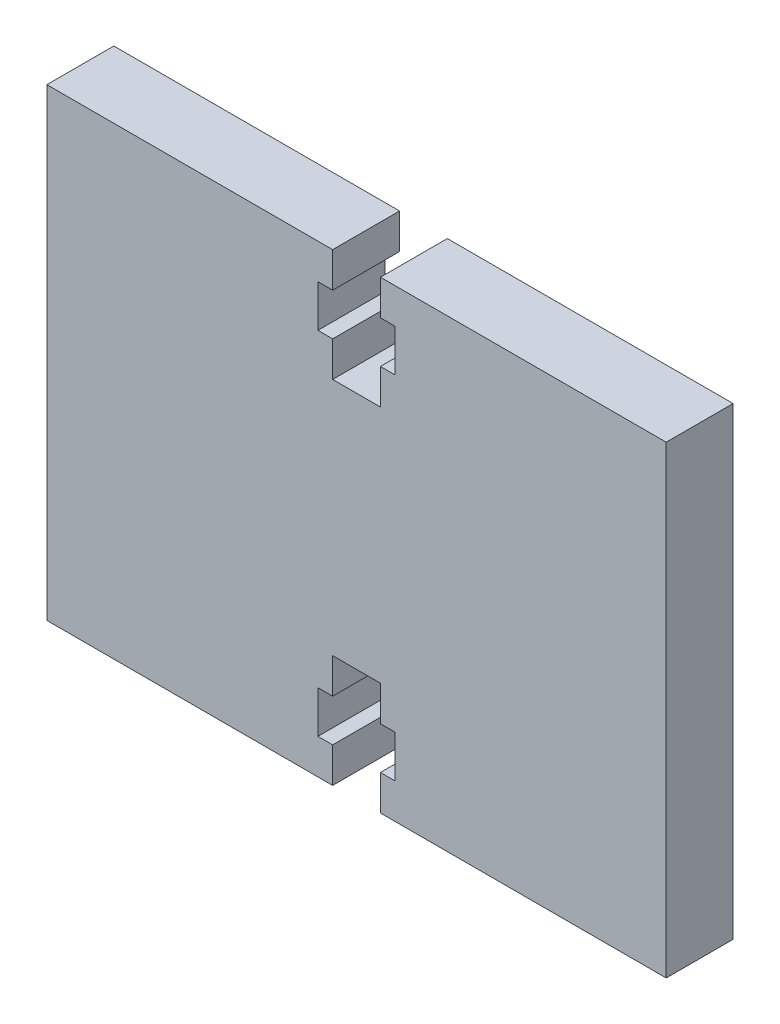
ISO-10303-21;
HEADER;
FILE_DESCRIPTION(('STEP AP214'),'2;1');
FILE_NAME('part.step','',(''),(''),'','','');
FILE_SCHEMA(('AUTOMOTIVE_DESIGN { 1 0 10303 214 1 1 1 1 }'));
ENDSEC;
DATA;
#1=APPLICATION_CONTEXT('core data for automotive mechanical design processes');
#2=APPLICATION_PROTOCOL_DEFINITION('international standard','automotive_design',2000,#1);
#3=PRODUCT_CONTEXT('',#1,'mechanical');
#4=PRODUCT('Part','Part','',(#3));
#5=PRODUCT_RELATED_PRODUCT_CATEGORY('part','',(#4));
#6=PRODUCT_DEFINITION_FORMATION('','',#4);
#7=PRODUCT_DEFINITION_CONTEXT('part definition',#1,'design');
#8=PRODUCT_DEFINITION('design','',#6,#7);
#9=PRODUCT_DEFINITION_SHAPE('','',#8);
#10=(LENGTH_UNIT() NAMED_UNIT(*) SI_UNIT(.MILLI.,.METRE.));
#11=(NAMED_UNIT(*) PLANE_ANGLE_UNIT() SI_UNIT($,.RADIAN.));
#12=(NAMED_UNIT(*) SI_UNIT($,.STERADIAN.) SOLID_ANGLE_UNIT());
#13=UNCERTAINTY_MEASURE_WITH_UNIT(LENGTH_MEASURE(1.E-05),#10,'distance_accuracy_value','');
#14=(GEOMETRIC_REPRESENTATION_CONTEXT(3) GLOBAL_UNCERTAINTY_ASSIGNED_CONTEXT((#13)) GLOBAL_UNIT_ASSIGNED_CONTEXT((#10,
#11,#12)) REPRESENTATION_CONTEXT('',''));
#15=CARTESIAN_POINT('',(0.,0.,0.));
#16=DIRECTION('',(0.,0.,1.));
#17=DIRECTION('',(1.,0.,0.));
#18=AXIS2_PLACEMENT_3D('',#15,#16,#17);
#19=CARTESIAN_POINT('',(1.69999999999999,16.51,4.7625));
#20=DIRECTION('',(0.,-1.,0.));
#21=DIRECTION('',(0.,0.,-1.));
#22=AXIS2_PLACEMENT_3D('',#19,#20,#21);
#23=PLANE('',#22);
#24=DIRECTION('',(-1.,0.,0.));
#25=VECTOR('',#24,1.);
#26=CARTESIAN_POINT('',(1.69999999999999,16.51,0.));
#27=LINE('',#26,#25);
#28=CARTESIAN_POINT('',(22.0345,16.51,0.));
#29=VERTEX_POINT('',#28);
#30=CARTESIAN_POINT('',(1.69999999999999,16.51,0.));
#31=VERTEX_POINT('',#30);
#32=EDGE_CURVE('E250',#29,#31,#27,.T.);
#33=ORIENTED_EDGE('',*,*,#32,.T.);
#34=DIRECTION('',(0.,0.,-1.));
#35=VECTOR('',#34,1.);
#36=CARTESIAN_POINT('',(1.69999999999999,16.51,4.7625));
#37=LINE('',#36,#35);
#38=CARTESIAN_POINT('',(1.69999999999999,16.51,4.7625));
#39=VERTEX_POINT('',#38);
#40=EDGE_CURVE('E11',#39,#31,#37,.T.);
#41=ORIENTED_EDGE('',*,*,#40,.F.);
#42=DIRECTION('',(-1.,0.,0.));
#43=VECTOR('',#42,1.);
#44=CARTESIAN_POINT('',(1.69999999999999,16.51,4.7625));
#45=LINE('',#44,#43);
#46=CARTESIAN_POINT('',(22.0345,16.51,4.7625));
#47=VERTEX_POINT('',#46);
#48=EDGE_CURVE('E309',#47,#39,#45,.T.);
#49=ORIENTED_EDGE('',*,*,#48,.F.);
#50=DIRECTION('',(0.,0.,-1.));
#51=VECTOR('',#50,1.);
#52=CARTESIAN_POINT('',(22.0345,16.51,4.7625));
#53=LINE('',#52,#51);
#54=EDGE_CURVE('E246',#47,#29,#53,.T.);
#55=ORIENTED_EDGE('',*,*,#54,.T.);
#56=EDGE_LOOP('',(#33,#41,#49,#55));
#57=FACE_BOUND('',#56,.T.);
#58=ADVANCED_FACE('F34',(#57),#23,.F.);
#59=CARTESIAN_POINT('',(1.69999999999999,16.51,4.7625));
#60=DIRECTION('',(1.,0.,0.));
#61=DIRECTION('',(0.,1.,0.));
#62=AXIS2_PLACEMENT_3D('',#59,#60,#61);
#63=PLANE('',#62);
#64=DIRECTION('',(0.,-1.,0.));
#65=VECTOR('',#64,1.);
#66=CARTESIAN_POINT('',(1.69999999999999,16.51,0.));
#67=LINE('',#66,#65);
#68=CARTESIAN_POINT('',(1.69999999999999,14.01,0.));
#69=VERTEX_POINT('',#68);
#70=EDGE_CURVE('E253',#31,#69,#67,.T.);
#71=ORIENTED_EDGE('',*,*,#70,.T.);
#72=DIRECTION('',(0.,0.,-1.));
#73=VECTOR('',#72,1.);
#74=CARTESIAN_POINT('',(1.69999999999999,14.01,4.7625));
#75=LINE('',#74,#73);
#76=CARTESIAN_POINT('',(1.69999999999999,14.01,4.7625));
#77=VERTEX_POINT('',#76);
#78=EDGE_CURVE('E42',#77,#69,#75,.T.);
#79=ORIENTED_EDGE('',*,*,#78,.F.);
#80=DIRECTION('',(0.,-1.,0.));
#81=VECTOR('',#80,1.);
#82=CARTESIAN_POINT('',(1.69999999999999,16.51,4.7625));
#83=LINE('',#82,#81);
#84=EDGE_CURVE('E153',#39,#77,#83,.T.);
#85=ORIENTED_EDGE('',*,*,#84,.F.);
#86=ORIENTED_EDGE('',*,*,#40,.T.);
#87=EDGE_LOOP('',(#71,#79,#85,#86));
#88=FACE_BOUND('',#87,.T.);
#89=ADVANCED_FACE('F474',(#88),#63,.F.);
#90=CARTESIAN_POINT('',(1.69999999999999,14.01,4.7625));
#91=DIRECTION('',(0.,1.,0.));
#92=DIRECTION('',(0.,0.,1.));
#93=AXIS2_PLACEMENT_3D('',#90,#91,#92);
#94=PLANE('',#93);
#95=DIRECTION('',(1.,0.,0.));
#96=VECTOR('',#95,1.);
#97=CARTESIAN_POINT('',(1.69999999999999,14.01,0.));
#98=LINE('',#97,#96);
#99=CARTESIAN_POINT('',(2.74999999999999,14.01,0.));
#100=VERTEX_POINT('',#99);
#101=EDGE_CURVE('E255',#69,#100,#98,.T.);
#102=ORIENTED_EDGE('',*,*,#101,.T.);
#103=DIRECTION('',(0.,0.,-1.));
#104=VECTOR('',#103,1.);
#105=CARTESIAN_POINT('',(2.74999999999999,14.01,4.7625));
#106=LINE('',#105,#104);
#107=CARTESIAN_POINT('',(2.74999999999999,14.01,4.7625));
#108=VERTEX_POINT('',#107);
#109=EDGE_CURVE('E379',#108,#100,#106,.T.);
#110=ORIENTED_EDGE('',*,*,#109,.F.);
#111=DIRECTION('',(1.,0.,0.));
#112=VECTOR('',#111,1.);
#113=CARTESIAN_POINT('',(1.69999999999999,14.01,4.7625));
#114=LINE('',#113,#112);
#115=EDGE_CURVE('E387',#77,#108,#114,.T.);
#116=ORIENTED_EDGE('',*,*,#115,.F.);
#117=ORIENTED_EDGE('',*,*,#78,.T.);
#118=EDGE_LOOP('',(#102,#110,#116,#117));
#119=FACE_BOUND('',#118,.T.);
#120=ADVANCED_FACE('F385',(#119),#94,.F.);
#121=CARTESIAN_POINT('',(2.74999999999999,14.01,4.7625));
#122=DIRECTION('',(1.,0.,0.));
#123=DIRECTION('',(0.,0.,-1.));
#124=AXIS2_PLACEMENT_3D('',#121,#122,#123);
#125=PLANE('',#124);
#126=DIRECTION('',(0.,-1.,0.));
#127=VECTOR('',#126,1.);
#128=CARTESIAN_POINT('',(2.74999999999999,14.01,0.));
#129=LINE('',#128,#127);
#130=CARTESIAN_POINT('',(2.74999999999999,11.01,0.));
#131=VERTEX_POINT('',#130);
#132=EDGE_CURVE('E257',#100,#131,#129,.T.);
#133=ORIENTED_EDGE('',*,*,#132,.T.);
#134=DIRECTION('',(0.,0.,-1.));
#135=VECTOR('',#134,1.);
#136=CARTESIAN_POINT('',(2.74999999999999,11.01,4.7625));
#137=LINE('',#136,#135);
#138=CARTESIAN_POINT('',(2.74999999999999,11.01,4.7625));
#139=VERTEX_POINT('',#138);
#140=EDGE_CURVE('E376',#139,#131,#137,.T.);
#141=ORIENTED_EDGE('',*,*,#140,.F.);
#142=DIRECTION('',(0.,-1.,0.));
#143=VECTOR('',#142,1.);
#144=CARTESIAN_POINT('',(2.74999999999999,14.01,4.7625));
#145=LINE('',#144,#143);
#146=EDGE_CURVE('E405',#108,#139,#145,.T.);
#147=ORIENTED_EDGE('',*,*,#146,.F.);
#148=ORIENTED_EDGE('',*,*,#109,.T.);
#149=EDGE_LOOP('',(#133,#141,#147,#148));
#150=FACE_BOUND('',#149,.T.);
#151=ADVANCED_FACE('F396',(#150),#125,.F.);
#152=CARTESIAN_POINT('',(2.74999999999999,11.01,4.7625));
#153=DIRECTION('',(0.,-1.,0.));
#154=DIRECTION('',(0.,0.,-1.));
#155=AXIS2_PLACEMENT_3D('',#152,#153,#154);
#156=PLANE('',#155);
#157=DIRECTION('',(-1.,0.,0.));
#158=VECTOR('',#157,1.);
#159=CARTESIAN_POINT('',(2.74999999999999,11.01,0.));
#160=LINE('',#159,#158);
#161=CARTESIAN_POINT('',(1.69999999999999,11.01,0.));
#162=VERTEX_POINT('',#161);
#163=EDGE_CURVE('E259',#131,#162,#160,.T.);
#164=ORIENTED_EDGE('',*,*,#163,.T.);
#165=DIRECTION('',(0.,0.,-1.));
#166=VECTOR('',#165,1.);
#167=CARTESIAN_POINT('',(1.69999999999999,11.01,4.7625));
#168=LINE('',#167,#166);
#169=CARTESIAN_POINT('',(1.69999999999999,11.01,4.7625));
#170=VERTEX_POINT('',#169);
#171=EDGE_CURVE('E373',#170,#162,#168,.T.);
#172=ORIENTED_EDGE('',*,*,#171,.F.);
#173=DIRECTION('',(-1.,0.,0.));
#174=VECTOR('',#173,1.);
#175=CARTESIAN_POINT('',(2.74999999999999,11.01,4.7625));
#176=LINE('',#175,#174);
#177=EDGE_CURVE('E402',#139,#170,#176,.T.);
#178=ORIENTED_EDGE('',*,*,#177,.F.);
#179=ORIENTED_EDGE('',*,*,#140,.T.);
#180=EDGE_LOOP('',(#164,#172,#178,#179));
#181=FACE_BOUND('',#180,.T.);
#182=ADVANCED_FACE('F400',(#181),#156,.F.);
#183=CARTESIAN_POINT('',(1.69999999999999,11.01,4.7625));
#184=DIRECTION('',(1.,0.,0.));
#185=DIRECTION('',(0.,1.,0.));
#186=AXIS2_PLACEMENT_3D('',#183,#184,#185);
#187=PLANE('',#186);
#188=DIRECTION('',(0.,-1.,0.));
#189=VECTOR('',#188,1.);
#190=CARTESIAN_POINT('',(1.69999999999999,11.01,0.));
#191=LINE('',#190,#189);
#192=CARTESIAN_POINT('',(1.69999999999999,8.51,0.));
#193=VERTEX_POINT('',#192);
#194=EDGE_CURVE('E261',#162,#193,#191,.T.);
#195=ORIENTED_EDGE('',*,*,#194,.T.);
#196=DIRECTION('',(0.,0.,-1.));
#197=VECTOR('',#196,1.);
#198=CARTESIAN_POINT('',(1.69999999999999,8.51,4.7625));
#199=LINE('',#198,#197);
#200=CARTESIAN_POINT('',(1.69999999999999,8.51,4.7625));
#201=VERTEX_POINT('',#200);
#202=EDGE_CURVE('E370',#201,#193,#199,.T.);
#203=ORIENTED_EDGE('',*,*,#202,.F.);
#204=DIRECTION('',(0.,-1.,0.));
#205=VECTOR('',#204,1.);
#206=CARTESIAN_POINT('',(1.69999999999999,11.01,4.7625));
#207=LINE('',#206,#205);
#208=EDGE_CURVE('E404',#170,#201,#207,.T.);
#209=ORIENTED_EDGE('',*,*,#208,.F.);
#210=ORIENTED_EDGE('',*,*,#171,.T.);
#211=EDGE_LOOP('',(#195,#203,#209,#210));
#212=FACE_BOUND('',#211,.T.);
#213=ADVANCED_FACE('F487',(#212),#187,.F.);
#214=CARTESIAN_POINT('',(-1.7,8.51,4.7625));
#215=DIRECTION('',(0.,-1.,0.));
#216=DIRECTION('',(0.,0.,-1.));
#217=AXIS2_PLACEMENT_3D('',#214,#215,#216);
#218=PLANE('',#217);
#219=DIRECTION('',(-1.,0.,0.));
#220=VECTOR('',#219,1.);
#221=CARTESIAN_POINT('',(-1.7,8.51,0.));
#222=LINE('',#221,#220);
#223=CARTESIAN_POINT('',(-1.7,8.51,0.));
#224=VERTEX_POINT('',#223);
#225=EDGE_CURVE('E263',#193,#224,#222,.T.);
#226=ORIENTED_EDGE('',*,*,#225,.T.);
#227=DIRECTION('',(0.,0.,-1.));
#228=VECTOR('',#227,1.);
#229=CARTESIAN_POINT('',(-1.7,8.51,4.7625));
#230=LINE('',#229,#228);
#231=CARTESIAN_POINT('',(-1.7,8.51,4.7625));
#232=VERTEX_POINT('',#231);
#233=EDGE_CURVE('E367',#232,#224,#230,.T.);
#234=ORIENTED_EDGE('',*,*,#233,.F.);
#235=DIRECTION('',(-1.,0.,0.));
#236=VECTOR('',#235,1.);
#237=CARTESIAN_POINT('',(-1.7,8.51,4.7625));
#238=LINE('',#237,#236);
#239=EDGE_CURVE('E407',#201,#232,#238,.T.);
#240=ORIENTED_EDGE('',*,*,#239,.F.);
#241=ORIENTED_EDGE('',*,*,#202,.T.);
#242=EDGE_LOOP('',(#226,#234,#240,#241));
#243=FACE_BOUND('',#242,.T.);
#244=ADVANCED_FACE('F490',(#243),#218,.F.);
#245=CARTESIAN_POINT('',(-1.7,11.01,4.7625));
#246=DIRECTION('',(-1.,0.,0.));
#247=DIRECTION('',(0.,-1.,0.));
#248=AXIS2_PLACEMENT_3D('',#245,#246,#247);
#249=PLANE('',#248);
#250=DIRECTION('',(0.,1.,0.));
#251=VECTOR('',#250,1.);
#252=CARTESIAN_POINT('',(-1.7,11.01,0.));
#253=LINE('',#252,#251);
#254=CARTESIAN_POINT('',(-1.7,11.01,0.));
#255=VERTEX_POINT('',#254);
#256=EDGE_CURVE('E266',#224,#255,#253,.T.);
#257=ORIENTED_EDGE('',*,*,#256,.T.);
#258=DIRECTION('',(0.,0.,-1.));
#259=VECTOR('',#258,1.);
#260=CARTESIAN_POINT('',(-1.7,11.01,4.7625));
#261=LINE('',#260,#259);
#262=CARTESIAN_POINT('',(-1.7,11.01,4.7625));
#263=VERTEX_POINT('',#262);
#264=EDGE_CURVE('E364',#263,#255,#261,.T.);
#265=ORIENTED_EDGE('',*,*,#264,.F.);
#266=DIRECTION('',(0.,1.,0.));
#267=VECTOR('',#266,1.);
#268=CARTESIAN_POINT('',(-1.7,11.01,4.7625));
#269=LINE('',#268,#267);
#270=EDGE_CURVE('E413',#232,#263,#269,.T.);
#271=ORIENTED_EDGE('',*,*,#270,.F.);
#272=ORIENTED_EDGE('',*,*,#233,.T.);
#273=EDGE_LOOP('',(#257,#265,#271,#272));
#274=FACE_BOUND('',#273,.T.);
#275=ADVANCED_FACE('F494',(#274),#249,.F.);
#276=CARTESIAN_POINT('',(-2.75,11.01,4.7625));
#277=DIRECTION('',(0.,-1.,0.));
#278=DIRECTION('',(0.,0.,-1.));
#279=AXIS2_PLACEMENT_3D('',#276,#277,#278);
#280=PLANE('',#279);
#281=DIRECTION('',(-1.,0.,0.));
#282=VECTOR('',#281,1.);
#283=CARTESIAN_POINT('',(-2.75,11.01,0.));
#284=LINE('',#283,#282);
#285=CARTESIAN_POINT('',(-2.75,11.01,0.));
#286=VERTEX_POINT('',#285);
#287=EDGE_CURVE('E268',#255,#286,#284,.T.);
#288=ORIENTED_EDGE('',*,*,#287,.T.);
#289=DIRECTION('',(0.,0.,-1.));
#290=VECTOR('',#289,1.);
#291=CARTESIAN_POINT('',(-2.75,11.01,4.7625));
#292=LINE('',#291,#290);
#293=CARTESIAN_POINT('',(-2.75,11.01,4.7625));
#294=VERTEX_POINT('',#293);
#295=EDGE_CURVE('E361',#294,#286,#292,.T.);
#296=ORIENTED_EDGE('',*,*,#295,.F.);
#297=DIRECTION('',(-1.,0.,0.));
#298=VECTOR('',#297,1.);
#299=CARTESIAN_POINT('',(-2.75,11.01,4.7625));
#300=LINE('',#299,#298);
#301=EDGE_CURVE('E415',#263,#294,#300,.T.);
#302=ORIENTED_EDGE('',*,*,#301,.F.);
#303=ORIENTED_EDGE('',*,*,#264,.T.);
#304=EDGE_LOOP('',(#288,#296,#302,#303));
#305=FACE_BOUND('',#304,.T.);
#306=ADVANCED_FACE('F498',(#305),#280,.F.);
#307=CARTESIAN_POINT('',(-2.75,14.01,4.7625));
#308=DIRECTION('',(-1.,0.,0.));
#309=DIRECTION('',(0.,0.,1.));
#310=AXIS2_PLACEMENT_3D('',#307,#308,#309);
#311=PLANE('',#310);
#312=DIRECTION('',(0.,1.,0.));
#313=VECTOR('',#312,1.);
#314=CARTESIAN_POINT('',(-2.75,14.01,0.));
#315=LINE('',#314,#313);
#316=CARTESIAN_POINT('',(-2.75,14.01,0.));
#317=VERTEX_POINT('',#316);
#318=EDGE_CURVE('E270',#286,#317,#315,.T.);
#319=ORIENTED_EDGE('',*,*,#318,.T.);
#320=DIRECTION('',(0.,0.,-1.));
#321=VECTOR('',#320,1.);
#322=CARTESIAN_POINT('',(-2.75,14.01,4.7625));
#323=LINE('',#322,#321);
#324=CARTESIAN_POINT('',(-2.75,14.01,4.7625));
#325=VERTEX_POINT('',#324);
#326=EDGE_CURVE('E358',#325,#317,#323,.T.);
#327=ORIENTED_EDGE('',*,*,#326,.F.);
#328=DIRECTION('',(0.,1.,0.));
#329=VECTOR('',#328,1.);
#330=CARTESIAN_POINT('',(-2.75,14.01,4.7625));
#331=LINE('',#330,#329);
#332=EDGE_CURVE('E417',#294,#325,#331,.T.);
#333=ORIENTED_EDGE('',*,*,#332,.F.);
#334=ORIENTED_EDGE('',*,*,#295,.T.);
#335=EDGE_LOOP('',(#319,#327,#333,#334));
#336=FACE_BOUND('',#335,.T.);
#337=ADVANCED_FACE('F502',(#336),#311,.F.);
#338=CARTESIAN_POINT('',(-1.7,14.01,4.7625));
#339=DIRECTION('',(0.,1.,0.));
#340=DIRECTION('',(0.,0.,1.));
#341=AXIS2_PLACEMENT_3D('',#338,#339,#340);
#342=PLANE('',#341);
#343=DIRECTION('',(1.,0.,0.));
#344=VECTOR('',#343,1.);
#345=CARTESIAN_POINT('',(-1.7,14.01,0.));
#346=LINE('',#345,#344);
#347=CARTESIAN_POINT('',(-1.7,14.01,0.));
#348=VERTEX_POINT('',#347);
#349=EDGE_CURVE('E272',#317,#348,#346,.T.);
#350=ORIENTED_EDGE('',*,*,#349,.T.);
#351=DIRECTION('',(0.,0.,-1.));
#352=VECTOR('',#351,1.);
#353=CARTESIAN_POINT('',(-1.7,14.01,4.7625));
#354=LINE('',#353,#352);
#355=CARTESIAN_POINT('',(-1.7,14.01,4.7625));
#356=VERTEX_POINT('',#355);
#357=EDGE_CURVE('E355',#356,#348,#354,.T.);
#358=ORIENTED_EDGE('',*,*,#357,.F.);
#359=DIRECTION('',(1.,0.,0.));
#360=VECTOR('',#359,1.);
#361=CARTESIAN_POINT('',(-1.7,14.01,4.7625));
#362=LINE('',#361,#360);
#363=EDGE_CURVE('E419',#325,#356,#362,.T.);
#364=ORIENTED_EDGE('',*,*,#363,.F.);
#365=ORIENTED_EDGE('',*,*,#326,.T.);
#366=EDGE_LOOP('',(#350,#358,#364,#365));
#367=FACE_BOUND('',#366,.T.);
#368=ADVANCED_FACE('F506',(#367),#342,.F.);
#369=CARTESIAN_POINT('',(-1.7,16.51,4.7625));
#370=DIRECTION('',(-1.,0.,0.));
#371=DIRECTION('',(0.,-1.,0.));
#372=AXIS2_PLACEMENT_3D('',#369,#370,#371);
#373=PLANE('',#372);
#374=DIRECTION('',(0.,1.,0.));
#375=VECTOR('',#374,1.);
#376=CARTESIAN_POINT('',(-1.7,16.51,0.));
#377=LINE('',#376,#375);
#378=CARTESIAN_POINT('',(-1.7,16.51,0.));
#379=VERTEX_POINT('',#378);
#380=EDGE_CURVE('E274',#348,#379,#377,.T.);
#381=ORIENTED_EDGE('',*,*,#380,.T.);
#382=DIRECTION('',(0.,0.,-1.));
#383=VECTOR('',#382,1.);
#384=CARTESIAN_POINT('',(-1.7,16.51,4.7625));
#385=LINE('',#384,#383);
#386=CARTESIAN_POINT('',(-1.7,16.51,4.7625));
#387=VERTEX_POINT('',#386);
#388=EDGE_CURVE('E352',#387,#379,#385,.T.);
#389=ORIENTED_EDGE('',*,*,#388,.F.);
#390=DIRECTION('',(0.,1.,0.));
#391=VECTOR('',#390,1.);
#392=CARTESIAN_POINT('',(-1.7,16.51,4.7625));
#393=LINE('',#392,#391);
#394=EDGE_CURVE('E421',#356,#387,#393,.T.);
#395=ORIENTED_EDGE('',*,*,#394,.F.);
#396=ORIENTED_EDGE('',*,*,#357,.T.);
#397=EDGE_LOOP('',(#381,#389,#395,#396));
#398=FACE_BOUND('',#397,.T.);
#399=ADVANCED_FACE('F510',(#398),#373,.F.);
#400=CARTESIAN_POINT('',(-22.0345,16.51,4.7625));
#401=DIRECTION('',(0.,-1.,0.));
#402=DIRECTION('',(0.,0.,-1.));
#403=AXIS2_PLACEMENT_3D('',#400,#401,#402);
#404=PLANE('',#403);
#405=DIRECTION('',(-1.,0.,0.));
#406=VECTOR('',#405,1.);
#407=CARTESIAN_POINT('',(-22.0345,16.51,0.));
#408=LINE('',#407,#406);
#409=CARTESIAN_POINT('',(-22.0345,16.51,0.));
#410=VERTEX_POINT('',#409);
#411=EDGE_CURVE('E276',#379,#410,#408,.T.);
#412=ORIENTED_EDGE('',*,*,#411,.T.);
#413=DIRECTION('',(0.,0.,-1.));
#414=VECTOR('',#413,1.);
#415=CARTESIAN_POINT('',(-22.0345,16.51,4.7625));
#416=LINE('',#415,#414);
#417=CARTESIAN_POINT('',(-22.0345,16.51,4.7625));
#418=VERTEX_POINT('',#417);
#419=EDGE_CURVE('E348',#418,#410,#416,.T.);
#420=ORIENTED_EDGE('',*,*,#419,.F.);
#421=DIRECTION('',(-1.,0.,0.));
#422=VECTOR('',#421,1.);
#423=CARTESIAN_POINT('',(-22.0345,16.51,4.7625));
#424=LINE('',#423,#422);
#425=EDGE_CURVE('E423',#387,#418,#424,.T.);
#426=ORIENTED_EDGE('',*,*,#425,.F.);
#427=ORIENTED_EDGE('',*,*,#388,.T.);
#428=EDGE_LOOP('',(#412,#420,#426,#427));
#429=FACE_BOUND('',#428,.T.);
#430=ADVANCED_FACE('F514',(#429),#404,.F.);
#431=CARTESIAN_POINT('',(-22.0345,-16.51,4.7625));
#432=DIRECTION('',(1.,0.,0.));
#433=DIRECTION('',(0.,0.,-1.));
#434=AXIS2_PLACEMENT_3D('',#431,#432,#433);
#435=PLANE('',#434);
#436=DIRECTION('',(0.,-1.,0.));
#437=VECTOR('',#436,1.);
#438=CARTESIAN_POINT('',(-22.0345,-16.51,0.));
#439=LINE('',#438,#437);
#440=CARTESIAN_POINT('',(-22.0345,-16.51,0.));
#441=VERTEX_POINT('',#440);
#442=EDGE_CURVE('E278',#410,#441,#439,.T.);
#443=ORIENTED_EDGE('',*,*,#442,.T.);
#444=DIRECTION('',(0.,0.,-1.));
#445=VECTOR('',#444,1.);
#446=CARTESIAN_POINT('',(-22.0345,-16.51,4.7625));
#447=LINE('',#446,#445);
#448=CARTESIAN_POINT('',(-22.0345,-16.51,4.7625));
#449=VERTEX_POINT('',#448);
#450=EDGE_CURVE('E345',#449,#441,#447,.T.);
#451=ORIENTED_EDGE('',*,*,#450,.F.);
#452=DIRECTION('',(0.,-1.,0.));
#453=VECTOR('',#452,1.);
#454=CARTESIAN_POINT('',(-22.0345,-16.51,4.7625));
#455=LINE('',#454,#453);
#456=EDGE_CURVE('E426',#418,#449,#455,.T.);
#457=ORIENTED_EDGE('',*,*,#456,.F.);
#458=ORIENTED_EDGE('',*,*,#419,.T.);
#459=EDGE_LOOP('',(#443,#451,#457,#458));
#460=FACE_BOUND('',#459,.T.);
#461=ADVANCED_FACE('F518',(#460),#435,.F.);
#462=CARTESIAN_POINT('',(-22.0345,-16.51,4.7625));
#463=DIRECTION('',(0.,1.,0.));
#464=DIRECTION('',(-1.,0.,0.));
#465=AXIS2_PLACEMENT_3D('',#462,#463,#464);
#466=PLANE('',#465);
#467=DIRECTION('',(1.,0.,0.));
#468=VECTOR('',#467,1.);
#469=CARTESIAN_POINT('',(-22.0345,-16.51,0.));
#470=LINE('',#469,#468);
#471=CARTESIAN_POINT('',(-1.69999999999999,-16.51,0.));
#472=VERTEX_POINT('',#471);
#473=EDGE_CURVE('E281',#441,#472,#470,.T.);
#474=ORIENTED_EDGE('',*,*,#473,.T.);
#475=DIRECTION('',(0.,0.,-1.));
#476=VECTOR('',#475,1.);
#477=CARTESIAN_POINT('',(-1.69999999999999,-16.51,4.7625));
#478=LINE('',#477,#476);
#479=CARTESIAN_POINT('',(-1.69999999999999,-16.51,4.7625));
#480=VERTEX_POINT('',#479);
#481=EDGE_CURVE('E341',#480,#472,#478,.T.);
#482=ORIENTED_EDGE('',*,*,#481,.F.);
#483=DIRECTION('',(1.,0.,0.));
#484=VECTOR('',#483,1.);
#485=CARTESIAN_POINT('',(-22.0345,-16.51,4.7625));
#486=LINE('',#485,#484);
#487=EDGE_CURVE('E429',#449,#480,#486,.T.);
#488=ORIENTED_EDGE('',*,*,#487,.F.);
#489=ORIENTED_EDGE('',*,*,#450,.T.);
#490=EDGE_LOOP('',(#474,#482,#488,#489));
#491=FACE_BOUND('',#490,.T.);
#492=ADVANCED_FACE('F522',(#491),#466,.F.);
#493=CARTESIAN_POINT('',(-1.69999999999999,-16.51,4.7625));
#494=DIRECTION('',(-1.,0.,0.));
#495=DIRECTION('',(0.,-1.,0.));
#496=AXIS2_PLACEMENT_3D('',#493,#494,#495);
#497=PLANE('',#496);
#498=DIRECTION('',(0.,1.,0.));
#499=VECTOR('',#498,1.);
#500=CARTESIAN_POINT('',(-1.69999999999999,-16.51,0.));
#501=LINE('',#500,#499);
#502=CARTESIAN_POINT('',(-1.69999999999999,-14.01,0.));
#503=VERTEX_POINT('',#502);
#504=EDGE_CURVE('E284',#472,#503,#501,.T.);
#505=ORIENTED_EDGE('',*,*,#504,.T.);
#506=DIRECTION('',(0.,0.,-1.));
#507=VECTOR('',#506,1.);
#508=CARTESIAN_POINT('',(-1.69999999999999,-14.01,4.7625));
#509=LINE('',#508,#507);
#510=CARTESIAN_POINT('',(-1.69999999999999,-14.01,4.7625));
#511=VERTEX_POINT('',#510);
#512=EDGE_CURVE('E337',#511,#503,#509,.T.);
#513=ORIENTED_EDGE('',*,*,#512,.F.);
#514=DIRECTION('',(0.,1.,0.));
#515=VECTOR('',#514,1.);
#516=CARTESIAN_POINT('',(-1.69999999999999,-16.51,4.7625));
#517=LINE('',#516,#515);
#518=EDGE_CURVE('E432',#480,#511,#517,.T.);
#519=ORIENTED_EDGE('',*,*,#518,.F.);
#520=ORIENTED_EDGE('',*,*,#481,.T.);
#521=EDGE_LOOP('',(#505,#513,#519,#520));
#522=FACE_BOUND('',#521,.T.);
#523=ADVANCED_FACE('F526',(#522),#497,.F.);
#524=CARTESIAN_POINT('',(-1.69999999999999,-14.01,4.7625));
#525=DIRECTION('',(0.,-1.,0.));
#526=DIRECTION('',(0.,0.,-1.));
#527=AXIS2_PLACEMENT_3D('',#524,#525,#526);
#528=PLANE('',#527);
#529=DIRECTION('',(-1.,0.,0.));
#530=VECTOR('',#529,1.);
#531=CARTESIAN_POINT('',(-1.69999999999999,-14.01,0.));
#532=LINE('',#531,#530);
#533=CARTESIAN_POINT('',(-2.74999999999999,-14.01,0.));
#534=VERTEX_POINT('',#533);
#535=EDGE_CURVE('E287',#503,#534,#532,.T.);
#536=ORIENTED_EDGE('',*,*,#535,.T.);
#537=DIRECTION('',(0.,0.,-1.));
#538=VECTOR('',#537,1.);
#539=CARTESIAN_POINT('',(-2.74999999999999,-14.01,4.7625));
#540=LINE('',#539,#538);
#541=CARTESIAN_POINT('',(-2.74999999999999,-14.01,4.7625));
#542=VERTEX_POINT('',#541);
#543=EDGE_CURVE('E334',#542,#534,#540,.T.);
#544=ORIENTED_EDGE('',*,*,#543,.F.);
#545=DIRECTION('',(-1.,0.,0.));
#546=VECTOR('',#545,1.);
#547=CARTESIAN_POINT('',(-1.69999999999999,-14.01,4.7625));
#548=LINE('',#547,#546);
#549=EDGE_CURVE('E434',#511,#542,#548,.T.);
#550=ORIENTED_EDGE('',*,*,#549,.F.);
#551=ORIENTED_EDGE('',*,*,#512,.T.);
#552=EDGE_LOOP('',(#536,#544,#550,#551));
#553=FACE_BOUND('',#552,.T.);
#554=ADVANCED_FACE('F530',(#553),#528,.F.);
#555=CARTESIAN_POINT('',(-2.74999999999999,-14.01,4.7625));
#556=DIRECTION('',(-1.,0.,0.));
#557=DIRECTION('',(0.,-1.,0.));
#558=AXIS2_PLACEMENT_3D('',#555,#556,#557);
#559=PLANE('',#558);
#560=DIRECTION('',(0.,1.,0.));
#561=VECTOR('',#560,1.);
#562=CARTESIAN_POINT('',(-2.74999999999999,-14.01,0.));
#563=LINE('',#562,#561);
#564=CARTESIAN_POINT('',(-2.75,-11.01,0.));
#565=VERTEX_POINT('',#564);
#566=EDGE_CURVE('E290',#534,#565,#563,.T.);
#567=ORIENTED_EDGE('',*,*,#566,.T.);
#568=DIRECTION('',(0.,0.,-1.));
#569=VECTOR('',#568,1.);
#570=CARTESIAN_POINT('',(-2.75,-11.01,4.7625));
#571=LINE('',#570,#569);
#572=CARTESIAN_POINT('',(-2.75,-11.01,4.7625));
#573=VERTEX_POINT('',#572);
#574=EDGE_CURVE('E331',#573,#565,#571,.T.);
#575=ORIENTED_EDGE('',*,*,#574,.F.);
#576=DIRECTION('',(0.,1.,0.));
#577=VECTOR('',#576,1.);
#578=CARTESIAN_POINT('',(-2.74999999999999,-14.01,4.7625));
#579=LINE('',#578,#577);
#580=EDGE_CURVE('E436',#542,#573,#579,.T.);
#581=ORIENTED_EDGE('',*,*,#580,.F.);
#582=ORIENTED_EDGE('',*,*,#543,.T.);
#583=EDGE_LOOP('',(#567,#575,#581,#582));
#584=FACE_BOUND('',#583,.T.);
#585=ADVANCED_FACE('F534',(#584),#559,.F.);
#586=CARTESIAN_POINT('',(-2.75,-11.01,4.7625));
#587=DIRECTION('',(0.,1.,0.));
#588=DIRECTION('',(0.,0.,1.));
#589=AXIS2_PLACEMENT_3D('',#586,#587,#588);
#590=PLANE('',#589);
#591=DIRECTION('',(1.,0.,0.));
#592=VECTOR('',#591,1.);
#593=CARTESIAN_POINT('',(-2.75,-11.01,0.));
#594=LINE('',#593,#592);
#595=CARTESIAN_POINT('',(-1.7,-11.01,0.));
#596=VERTEX_POINT('',#595);
#597=EDGE_CURVE('E292',#565,#596,#594,.T.);
#598=ORIENTED_EDGE('',*,*,#597,.T.);
#599=DIRECTION('',(0.,0.,-1.));
#600=VECTOR('',#599,1.);
#601=CARTESIAN_POINT('',(-1.7,-11.01,4.7625));
#602=LINE('',#601,#600);
#603=CARTESIAN_POINT('',(-1.7,-11.01,4.7625));
#604=VERTEX_POINT('',#603);
#605=EDGE_CURVE('E328',#604,#596,#602,.T.);
#606=ORIENTED_EDGE('',*,*,#605,.F.);
#607=DIRECTION('',(1.,0.,0.));
#608=VECTOR('',#607,1.);
#609=CARTESIAN_POINT('',(-2.75,-11.01,4.7625));
#610=LINE('',#609,#608);
#611=EDGE_CURVE('E438',#573,#604,#610,.T.);
#612=ORIENTED_EDGE('',*,*,#611,.F.);
#613=ORIENTED_EDGE('',*,*,#574,.T.);
#614=EDGE_LOOP('',(#598,#606,#612,#613));
#615=FACE_BOUND('',#614,.T.);
#616=ADVANCED_FACE('F538',(#615),#590,.F.);
#617=CARTESIAN_POINT('',(-1.7,-11.01,4.7625));
#618=DIRECTION('',(-1.,0.,0.));
#619=DIRECTION('',(0.,-1.,0.));
#620=AXIS2_PLACEMENT_3D('',#617,#618,#619);
#621=PLANE('',#620);
#622=DIRECTION('',(0.,1.,0.));
#623=VECTOR('',#622,1.);
#624=CARTESIAN_POINT('',(-1.7,-11.01,0.));
#625=LINE('',#624,#623);
#626=CARTESIAN_POINT('',(-1.7,-8.51,0.));
#627=VERTEX_POINT('',#626);
#628=EDGE_CURVE('E294',#596,#627,#625,.T.);
#629=ORIENTED_EDGE('',*,*,#628,.T.);
#630=DIRECTION('',(0.,0.,-1.));
#631=VECTOR('',#630,1.);
#632=CARTESIAN_POINT('',(-1.7,-8.51,4.7625));
#633=LINE('',#632,#631);
#634=CARTESIAN_POINT('',(-1.7,-8.51,4.7625));
#635=VERTEX_POINT('',#634);
#636=EDGE_CURVE('E325',#635,#627,#633,.T.);
#637=ORIENTED_EDGE('',*,*,#636,.F.);
#638=DIRECTION('',(0.,1.,0.));
#639=VECTOR('',#638,1.);
#640=CARTESIAN_POINT('',(-1.7,-11.01,4.7625));
#641=LINE('',#640,#639);
#642=EDGE_CURVE('E440',#604,#635,#641,.T.);
#643=ORIENTED_EDGE('',*,*,#642,.F.);
#644=ORIENTED_EDGE('',*,*,#605,.T.);
#645=EDGE_LOOP('',(#629,#637,#643,#644));
#646=FACE_BOUND('',#645,.T.);
#647=ADVANCED_FACE('F542',(#646),#621,.F.);
#648=CARTESIAN_POINT('',(-1.7,-8.51,4.7625));
#649=DIRECTION('',(0.,1.,0.));
#650=DIRECTION('',(0.,0.,1.));
#651=AXIS2_PLACEMENT_3D('',#648,#649,#650);
#652=PLANE('',#651);
#653=DIRECTION('',(1.,0.,0.));
#654=VECTOR('',#653,1.);
#655=CARTESIAN_POINT('',(-1.7,-8.51,0.));
#656=LINE('',#655,#654);
#657=CARTESIAN_POINT('',(1.69999999999999,-8.51,0.));
#658=VERTEX_POINT('',#657);
#659=EDGE_CURVE('E296',#627,#658,#656,.T.);
#660=ORIENTED_EDGE('',*,*,#659,.T.);
#661=DIRECTION('',(0.,0.,-1.));
#662=VECTOR('',#661,1.);
#663=CARTESIAN_POINT('',(1.69999999999999,-8.51,4.7625));
#664=LINE('',#663,#662);
#665=CARTESIAN_POINT('',(1.69999999999999,-8.51,4.7625));
#666=VERTEX_POINT('',#665);
#667=EDGE_CURVE('E322',#666,#658,#664,.T.);
#668=ORIENTED_EDGE('',*,*,#667,.F.);
#669=DIRECTION('',(1.,0.,0.));
#670=VECTOR('',#669,1.);
#671=CARTESIAN_POINT('',(-1.7,-8.51,4.7625));
#672=LINE('',#671,#670);
#673=EDGE_CURVE('E442',#635,#666,#672,.T.);
#674=ORIENTED_EDGE('',*,*,#673,.F.);
#675=ORIENTED_EDGE('',*,*,#636,.T.);
#676=EDGE_LOOP('',(#660,#668,#674,#675));
#677=FACE_BOUND('',#676,.T.);
#678=ADVANCED_FACE('F546',(#677),#652,.F.);
#679=CARTESIAN_POINT('',(1.7,-11.01,4.7625));
#680=DIRECTION('',(1.,0.,0.));
#681=DIRECTION('',(0.,1.,0.));
#682=AXIS2_PLACEMENT_3D('',#679,#680,#681);
#683=PLANE('',#682);
#684=DIRECTION('',(0.,-1.,0.));
#685=VECTOR('',#684,1.);
#686=CARTESIAN_POINT('',(1.7,-11.01,0.));
#687=LINE('',#686,#685);
#688=CARTESIAN_POINT('',(1.7,-11.01,0.));
#689=VERTEX_POINT('',#688);
#690=EDGE_CURVE('E298',#658,#689,#687,.T.);
#691=ORIENTED_EDGE('',*,*,#690,.T.);
#692=DIRECTION('',(0.,0.,-1.));
#693=VECTOR('',#692,1.);
#694=CARTESIAN_POINT('',(1.7,-11.01,4.7625));
#695=LINE('',#694,#693);
#696=CARTESIAN_POINT('',(1.7,-11.01,4.7625));
#697=VERTEX_POINT('',#696);
#698=EDGE_CURVE('E319',#697,#689,#695,.T.);
#699=ORIENTED_EDGE('',*,*,#698,.F.);
#700=DIRECTION('',(0.,-1.,0.));
#701=VECTOR('',#700,1.);
#702=CARTESIAN_POINT('',(1.7,-11.01,4.7625));
#703=LINE('',#702,#701);
#704=EDGE_CURVE('E445',#666,#697,#703,.T.);
#705=ORIENTED_EDGE('',*,*,#704,.F.);
#706=ORIENTED_EDGE('',*,*,#667,.T.);
#707=EDGE_LOOP('',(#691,#699,#705,#706));
#708=FACE_BOUND('',#707,.T.);
#709=ADVANCED_FACE('F550',(#708),#683,.F.);
#710=CARTESIAN_POINT('',(2.75,-11.01,4.7625));
#711=DIRECTION('',(0.,1.,0.));
#712=DIRECTION('',(0.,0.,1.));
#713=AXIS2_PLACEMENT_3D('',#710,#711,#712);
#714=PLANE('',#713);
#715=DIRECTION('',(1.,0.,0.));
#716=VECTOR('',#715,1.);
#717=CARTESIAN_POINT('',(2.75,-11.01,0.));
#718=LINE('',#717,#716);
#719=CARTESIAN_POINT('',(2.75,-11.01,0.));
#720=VERTEX_POINT('',#719);
#721=EDGE_CURVE('E300',#689,#720,#718,.T.);
#722=ORIENTED_EDGE('',*,*,#721,.T.);
#723=DIRECTION('',(0.,0.,-1.));
#724=VECTOR('',#723,1.);
#725=CARTESIAN_POINT('',(2.75,-11.01,4.7625));
#726=LINE('',#725,#724);
#727=CARTESIAN_POINT('',(2.75,-11.01,4.7625));
#728=VERTEX_POINT('',#727);
#729=EDGE_CURVE('E316',#728,#720,#726,.T.);
#730=ORIENTED_EDGE('',*,*,#729,.F.);
#731=DIRECTION('',(1.,0.,0.));
#732=VECTOR('',#731,1.);
#733=CARTESIAN_POINT('',(2.75,-11.01,4.7625));
#734=LINE('',#733,#732);
#735=EDGE_CURVE('E447',#697,#728,#734,.T.);
#736=ORIENTED_EDGE('',*,*,#735,.F.);
#737=ORIENTED_EDGE('',*,*,#698,.T.);
#738=EDGE_LOOP('',(#722,#730,#736,#737));
#739=FACE_BOUND('',#738,.T.);
#740=ADVANCED_FACE('F554',(#739),#714,.F.);
#741=CARTESIAN_POINT('',(2.75,-14.01,4.7625));
#742=DIRECTION('',(1.,0.,0.));
#743=DIRECTION('',(0.,1.,0.));
#744=AXIS2_PLACEMENT_3D('',#741,#742,#743);
#745=PLANE('',#744);
#746=DIRECTION('',(0.,-1.,0.));
#747=VECTOR('',#746,1.);
#748=CARTESIAN_POINT('',(2.75,-14.01,0.));
#749=LINE('',#748,#747);
#750=CARTESIAN_POINT('',(2.75,-14.01,0.));
#751=VERTEX_POINT('',#750);
#752=EDGE_CURVE('E302',#720,#751,#749,.T.);
#753=ORIENTED_EDGE('',*,*,#752,.T.);
#754=DIRECTION('',(0.,0.,-1.));
#755=VECTOR('',#754,1.);
#756=CARTESIAN_POINT('',(2.75,-14.01,4.7625));
#757=LINE('',#756,#755);
#758=CARTESIAN_POINT('',(2.75,-14.01,4.7625));
#759=VERTEX_POINT('',#758);
#760=EDGE_CURVE('E313',#759,#751,#757,.T.);
#761=ORIENTED_EDGE('',*,*,#760,.F.);
#762=DIRECTION('',(0.,-1.,0.));
#763=VECTOR('',#762,1.);
#764=CARTESIAN_POINT('',(2.75,-14.01,4.7625));
#765=LINE('',#764,#763);
#766=EDGE_CURVE('E449',#728,#759,#765,.T.);
#767=ORIENTED_EDGE('',*,*,#766,.F.);
#768=ORIENTED_EDGE('',*,*,#729,.T.);
#769=EDGE_LOOP('',(#753,#761,#767,#768));
#770=FACE_BOUND('',#769,.T.);
#771=ADVANCED_FACE('F455',(#770),#745,.F.);
#772=CARTESIAN_POINT('',(1.7,-14.01,4.7625));
#773=DIRECTION('',(0.,-1.,0.));
#774=DIRECTION('',(0.,0.,-1.));
#775=AXIS2_PLACEMENT_3D('',#772,#773,#774);
#776=PLANE('',#775);
#777=DIRECTION('',(-1.,0.,0.));
#778=VECTOR('',#777,1.);
#779=CARTESIAN_POINT('',(1.7,-14.01,0.));
#780=LINE('',#779,#778);
#781=CARTESIAN_POINT('',(1.7,-14.01,0.));
#782=VERTEX_POINT('',#781);
#783=EDGE_CURVE('E304',#751,#782,#780,.T.);
#784=ORIENTED_EDGE('',*,*,#783,.T.);
#785=DIRECTION('',(0.,0.,-1.));
#786=VECTOR('',#785,1.);
#787=CARTESIAN_POINT('',(1.7,-14.01,4.7625));
#788=LINE('',#787,#786);
#789=CARTESIAN_POINT('',(1.7,-14.01,4.7625));
#790=VERTEX_POINT('',#789);
#791=EDGE_CURVE('E241',#790,#782,#788,.T.);
#792=ORIENTED_EDGE('',*,*,#791,.F.);
#793=DIRECTION('',(-1.,0.,0.));
#794=VECTOR('',#793,1.);
#795=CARTESIAN_POINT('',(1.7,-14.01,4.7625));
#796=LINE('',#795,#794);
#797=EDGE_CURVE('E232',#759,#790,#796,.T.);
#798=ORIENTED_EDGE('',*,*,#797,.F.);
#799=ORIENTED_EDGE('',*,*,#760,.T.);
#800=EDGE_LOOP('',(#784,#792,#798,#799));
#801=FACE_BOUND('',#800,.T.);
#802=ADVANCED_FACE('F459',(#801),#776,.F.);
#803=CARTESIAN_POINT('',(1.7,-16.51,4.7625));
#804=DIRECTION('',(1.,0.,0.));
#805=DIRECTION('',(0.,1.,0.));
#806=AXIS2_PLACEMENT_3D('',#803,#804,#805);
#807=PLANE('',#806);
#808=DIRECTION('',(0.,-1.,0.));
#809=VECTOR('',#808,1.);
#810=CARTESIAN_POINT('',(1.7,-16.51,0.));
#811=LINE('',#810,#809);
#812=CARTESIAN_POINT('',(1.7,-16.51,0.));
#813=VERTEX_POINT('',#812);
#814=EDGE_CURVE('E240',#782,#813,#811,.T.);
#815=ORIENTED_EDGE('',*,*,#814,.T.);
#816=DIRECTION('',(0.,0.,-1.));
#817=VECTOR('',#816,1.);
#818=CARTESIAN_POINT('',(1.7,-16.51,4.7625));
#819=LINE('',#818,#817);
#820=CARTESIAN_POINT('',(1.7,-16.51,4.7625));
#821=VERTEX_POINT('',#820);
#822=EDGE_CURVE('E237',#821,#813,#819,.T.);
#823=ORIENTED_EDGE('',*,*,#822,.F.);
#824=DIRECTION('',(0.,-1.,0.));
#825=VECTOR('',#824,1.);
#826=CARTESIAN_POINT('',(1.7,-16.51,4.7625));
#827=LINE('',#826,#825);
#828=EDGE_CURVE('E226',#790,#821,#827,.T.);
#829=ORIENTED_EDGE('',*,*,#828,.F.);
#830=ORIENTED_EDGE('',*,*,#791,.T.);
#831=EDGE_LOOP('',(#815,#823,#829,#830));
#832=FACE_BOUND('',#831,.T.);
#833=ADVANCED_FACE('F238',(#832),#807,.F.);
#834=CARTESIAN_POINT('',(1.7,-16.51,4.7625));
#835=DIRECTION('',(0.,1.,0.));
#836=DIRECTION('',(-1.,0.,0.));
#837=AXIS2_PLACEMENT_3D('',#834,#835,#836);
#838=PLANE('',#837);
#839=DIRECTION('',(1.,0.,0.));
#840=VECTOR('',#839,1.);
#841=CARTESIAN_POINT('',(1.7,-16.51,0.));
#842=LINE('',#841,#840);
#843=CARTESIAN_POINT('',(22.0345,-16.51,0.));
#844=VERTEX_POINT('',#843);
#845=EDGE_CURVE('E139',#813,#844,#842,.T.);
#846=ORIENTED_EDGE('',*,*,#845,.T.);
#847=DIRECTION('',(0.,0.,-1.));
#848=VECTOR('',#847,1.);
#849=CARTESIAN_POINT('',(22.0345,-16.51,4.7625));
#850=LINE('',#849,#848);
#851=CARTESIAN_POINT('',(22.0345,-16.51,4.7625));
#852=VERTEX_POINT('',#851);
#853=EDGE_CURVE('E242',#852,#844,#850,.T.);
#854=ORIENTED_EDGE('',*,*,#853,.F.);
#855=DIRECTION('',(1.,0.,0.));
#856=VECTOR('',#855,1.);
#857=CARTESIAN_POINT('',(1.7,-16.51,4.7625));
#858=LINE('',#857,#856);
#859=EDGE_CURVE('E230',#821,#852,#858,.T.);
#860=ORIENTED_EDGE('',*,*,#859,.F.);
#861=ORIENTED_EDGE('',*,*,#822,.T.);
#862=EDGE_LOOP('',(#846,#854,#860,#861));
#863=FACE_BOUND('',#862,.T.);
#864=ADVANCED_FACE('F244',(#863),#838,.F.);
#865=CARTESIAN_POINT('',(22.0345,-16.51,4.7625));
#866=DIRECTION('',(-1.,0.,0.));
#867=DIRECTION('',(0.,0.,1.));
#868=AXIS2_PLACEMENT_3D('',#865,#866,#867);
#869=PLANE('',#868);
#870=DIRECTION('',(0.,1.,0.));
#871=VECTOR('',#870,1.);
#872=CARTESIAN_POINT('',(22.0345,-16.51,0.));
#873=LINE('',#872,#871);
#874=EDGE_CURVE('E145',#844,#29,#873,.T.);
#875=ORIENTED_EDGE('',*,*,#874,.T.);
#876=ORIENTED_EDGE('',*,*,#54,.F.);
#877=DIRECTION('',(0.,1.,0.));
#878=VECTOR('',#877,1.);
#879=CARTESIAN_POINT('',(22.0345,-16.51,4.7625));
#880=LINE('',#879,#878);
#881=EDGE_CURVE('E50',#852,#47,#880,.T.);
#882=ORIENTED_EDGE('',*,*,#881,.F.);
#883=ORIENTED_EDGE('',*,*,#853,.T.);
#884=EDGE_LOOP('',(#875,#876,#882,#883));
#885=FACE_BOUND('',#884,.T.);
#886=ADVANCED_FACE('F463',(#885),#869,.F.);
#887=CARTESIAN_POINT('',(0.,0.,4.7625));
#888=DIRECTION('',(0.,0.,1.));
#889=DIRECTION('',(1.,0.,0.));
#890=AXIS2_PLACEMENT_3D('',#887,#888,#889);
#891=PLANE('',#890);
#892=ORIENTED_EDGE('',*,*,#48,.T.);
#893=ORIENTED_EDGE('',*,*,#84,.T.);
#894=ORIENTED_EDGE('',*,*,#115,.T.);
#895=ORIENTED_EDGE('',*,*,#146,.T.);
#896=ORIENTED_EDGE('',*,*,#177,.T.);
#897=ORIENTED_EDGE('',*,*,#208,.T.);
#898=ORIENTED_EDGE('',*,*,#239,.T.);
#899=ORIENTED_EDGE('',*,*,#270,.T.);
#900=ORIENTED_EDGE('',*,*,#301,.T.);
#901=ORIENTED_EDGE('',*,*,#332,.T.);
#902=ORIENTED_EDGE('',*,*,#363,.T.);
#903=ORIENTED_EDGE('',*,*,#394,.T.);
#904=ORIENTED_EDGE('',*,*,#425,.T.);
#905=ORIENTED_EDGE('',*,*,#456,.T.);
#906=ORIENTED_EDGE('',*,*,#487,.T.);
#907=ORIENTED_EDGE('',*,*,#518,.T.);
#908=ORIENTED_EDGE('',*,*,#549,.T.);
#909=ORIENTED_EDGE('',*,*,#580,.T.);
#910=ORIENTED_EDGE('',*,*,#611,.T.);
#911=ORIENTED_EDGE('',*,*,#642,.T.);
#912=ORIENTED_EDGE('',*,*,#673,.T.);
#913=ORIENTED_EDGE('',*,*,#704,.T.);
#914=ORIENTED_EDGE('',*,*,#735,.T.);
#915=ORIENTED_EDGE('',*,*,#766,.T.);
#916=ORIENTED_EDGE('',*,*,#797,.T.);
#917=ORIENTED_EDGE('',*,*,#828,.T.);
#918=ORIENTED_EDGE('',*,*,#859,.T.);
#919=ORIENTED_EDGE('',*,*,#881,.T.);
#920=EDGE_LOOP('',(#892,#893,#894,#895,#896,#897,#898,#899,#900,#901,#902,#903,#904,#905,#906,
#907,#908,#909,#910,#911,#912,#913,#914,#915,#916,#917,#918,#919));
#921=FACE_BOUND('',#920,.T.);
#922=ADVANCED_FACE('F228',(#921),#891,.T.);
#923=CARTESIAN_POINT('',(0.,0.,0.));
#924=DIRECTION('',(0.,0.,1.));
#925=DIRECTION('',(1.,0.,0.));
#926=AXIS2_PLACEMENT_3D('',#923,#924,#925);
#927=PLANE('',#926);
#928=ORIENTED_EDGE('',*,*,#32,.F.);
#929=ORIENTED_EDGE('',*,*,#874,.F.);
#930=ORIENTED_EDGE('',*,*,#845,.F.);
#931=ORIENTED_EDGE('',*,*,#814,.F.);
#932=ORIENTED_EDGE('',*,*,#783,.F.);
#933=ORIENTED_EDGE('',*,*,#752,.F.);
#934=ORIENTED_EDGE('',*,*,#721,.F.);
#935=ORIENTED_EDGE('',*,*,#690,.F.);
#936=ORIENTED_EDGE('',*,*,#659,.F.);
#937=ORIENTED_EDGE('',*,*,#628,.F.);
#938=ORIENTED_EDGE('',*,*,#597,.F.);
#939=ORIENTED_EDGE('',*,*,#566,.F.);
#940=ORIENTED_EDGE('',*,*,#535,.F.);
#941=ORIENTED_EDGE('',*,*,#504,.F.);
#942=ORIENTED_EDGE('',*,*,#473,.F.);
#943=ORIENTED_EDGE('',*,*,#442,.F.);
#944=ORIENTED_EDGE('',*,*,#411,.F.);
#945=ORIENTED_EDGE('',*,*,#380,.F.);
#946=ORIENTED_EDGE('',*,*,#349,.F.);
#947=ORIENTED_EDGE('',*,*,#318,.F.);
#948=ORIENTED_EDGE('',*,*,#287,.F.);
#949=ORIENTED_EDGE('',*,*,#256,.F.);
#950=ORIENTED_EDGE('',*,*,#225,.F.);
#951=ORIENTED_EDGE('',*,*,#194,.F.);
#952=ORIENTED_EDGE('',*,*,#163,.F.);
#953=ORIENTED_EDGE('',*,*,#132,.F.);
#954=ORIENTED_EDGE('',*,*,#101,.F.);
#955=ORIENTED_EDGE('',*,*,#70,.F.);
#956=EDGE_LOOP('',(#928,#929,#930,#931,#932,#933,#934,#935,#936,#937,#938,#939,#940,#941,#942,
#943,#944,#945,#946,#947,#948,#949,#950,#951,#952,#953,#954,#955));
#957=FACE_BOUND('',#956,.T.);
#958=ADVANCED_FACE('F391',(#957),#927,.F.);
#959=CLOSED_SHELL('',(#58,#89,#120,#151,#182,#213,#244,#275,#306,#337,#368,#399,#430,#461,#492,
#523,#554,#585,#616,#647,#678,#709,#740,#771,#802,#833,#864,#886,#922,#958));
#960=MANIFOLD_SOLID_BREP('B2',#959);
#961=ADVANCED_BREP_SHAPE_REPRESENTATION('',(#18,#960),#14);
#962=SHAPE_DEFINITION_REPRESENTATION(#9,#961);
ENDSEC;
END-ISO-10303-21;
